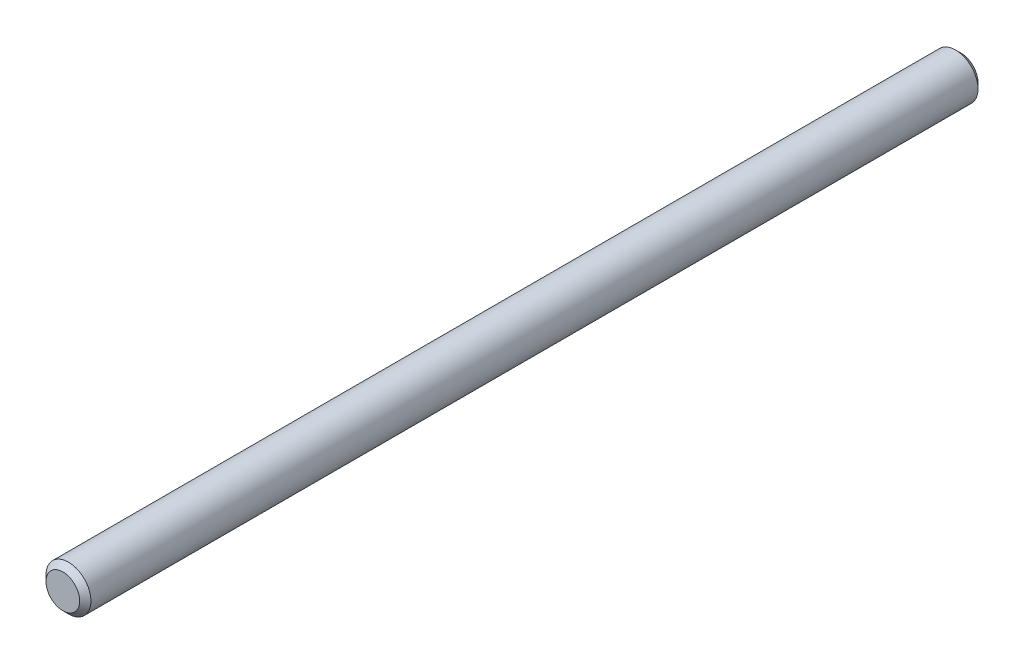
ISO-10303-21;
HEADER;
FILE_DESCRIPTION(('STEP AP214'),'2;1');
FILE_NAME('part.step','',(''),(''),'','','');
FILE_SCHEMA(('AUTOMOTIVE_DESIGN { 1 0 10303 214 1 1 1 1 }'));
ENDSEC;
DATA;
#1=APPLICATION_CONTEXT('core data for automotive mechanical design processes');
#2=APPLICATION_PROTOCOL_DEFINITION('international standard','automotive_design',2000,#1);
#3=PRODUCT_CONTEXT('',#1,'mechanical');
#4=PRODUCT('Part','Part','',(#3));
#5=PRODUCT_RELATED_PRODUCT_CATEGORY('part','',(#4));
#6=PRODUCT_DEFINITION_FORMATION('','',#4);
#7=PRODUCT_DEFINITION_CONTEXT('part definition',#1,'design');
#8=PRODUCT_DEFINITION('design','',#6,#7);
#9=PRODUCT_DEFINITION_SHAPE('','',#8);
#10=(LENGTH_UNIT() NAMED_UNIT(*) SI_UNIT(.MILLI.,.METRE.));
#11=(NAMED_UNIT(*) PLANE_ANGLE_UNIT() SI_UNIT($,.RADIAN.));
#12=(NAMED_UNIT(*) SI_UNIT($,.STERADIAN.) SOLID_ANGLE_UNIT());
#13=UNCERTAINTY_MEASURE_WITH_UNIT(LENGTH_MEASURE(1.E-05),#10,'distance_accuracy_value','');
#14=(GEOMETRIC_REPRESENTATION_CONTEXT(3) GLOBAL_UNCERTAINTY_ASSIGNED_CONTEXT((#13)) GLOBAL_UNIT_ASSIGNED_CONTEXT((#10,
#11,#12)) REPRESENTATION_CONTEXT('',''));
#15=CARTESIAN_POINT('',(0.,0.,0.));
#16=DIRECTION('',(0.,0.,1.));
#17=DIRECTION('',(1.,0.,0.));
#18=AXIS2_PLACEMENT_3D('',#15,#16,#17);
#19=CARTESIAN_POINT('',(0.,0.,160.));
#20=DIRECTION('',(0.,0.,-1.));
#21=DIRECTION('',(-1.,0.,0.));
#22=AXIS2_PLACEMENT_3D('',#19,#20,#21);
#23=CYLINDRICAL_SURFACE('',#22,4.);
#24=CARTESIAN_POINT('',(0.,0.,159.));
#25=DIRECTION('',(0.,0.,1.));
#26=DIRECTION('',(1.,0.,0.));
#27=AXIS2_PLACEMENT_3D('',#24,#25,#26);
#28=CIRCLE('',#27,4.);
#29=CARTESIAN_POINT('',(4.,0.,159.));
#30=VERTEX_POINT('',#29);
#31=EDGE_CURVE('E38',#30,#30,#28,.F.);
#32=ORIENTED_EDGE('',*,*,#31,.T.);
#33=EDGE_LOOP('',(#32));
#34=FACE_BOUND('',#33,.T.);
#35=CARTESIAN_POINT('',(0.,0.,0.999999999999973));
#36=DIRECTION('',(0.,0.,1.));
#37=DIRECTION('',(1.,0.,0.));
#38=AXIS2_PLACEMENT_3D('',#35,#36,#37);
#39=CIRCLE('',#38,4.);
#40=CARTESIAN_POINT('',(4.,0.,0.999999999999973));
#41=VERTEX_POINT('',#40);
#42=EDGE_CURVE('E42',#41,#41,#39,.T.);
#43=ORIENTED_EDGE('',*,*,#42,.T.);
#44=EDGE_LOOP('',(#43));
#45=FACE_BOUND('',#44,.T.);
#46=ADVANCED_FACE('F31',(#34,#45),#23,.T.);
#47=CARTESIAN_POINT('',(0.,0.,160.));
#48=DIRECTION('',(0.,0.,1.));
#49=DIRECTION('',(1.,0.,0.));
#50=AXIS2_PLACEMENT_3D('',#47,#48,#49);
#51=PLANE('',#50);
#52=CARTESIAN_POINT('',(0.,0.,160.));
#53=DIRECTION('',(0.,0.,1.));
#54=DIRECTION('',(1.,0.,0.));
#55=AXIS2_PLACEMENT_3D('',#52,#53,#54);
#56=CIRCLE('',#55,3.);
#57=CARTESIAN_POINT('',(3.,0.,160.));
#58=VERTEX_POINT('',#57);
#59=EDGE_CURVE('E46',#58,#58,#56,.T.);
#60=ORIENTED_EDGE('',*,*,#59,.T.);
#61=EDGE_LOOP('',(#60));
#62=FACE_BOUND('',#61,.T.);
#63=ADVANCED_FACE('F52',(#62),#51,.T.);
#64=CARTESIAN_POINT('',(0.,0.,0.));
#65=DIRECTION('',(0.,0.,1.));
#66=DIRECTION('',(1.,0.,0.));
#67=AXIS2_PLACEMENT_3D('',#64,#65,#66);
#68=PLANE('',#67);
#69=CARTESIAN_POINT('',(0.,0.,0.));
#70=DIRECTION('',(0.,0.,1.));
#71=DIRECTION('',(1.,0.,0.));
#72=AXIS2_PLACEMENT_3D('',#69,#70,#71);
#73=CIRCLE('',#72,3.);
#74=CARTESIAN_POINT('',(3.,0.,0.));
#75=VERTEX_POINT('',#74);
#76=EDGE_CURVE('E10',#75,#75,#73,.F.);
#77=ORIENTED_EDGE('',*,*,#76,.T.);
#78=EDGE_LOOP('',(#77));
#79=FACE_BOUND('',#78,.T.);
#80=ADVANCED_FACE('F56',(#79),#68,.F.);
#81=CARTESIAN_POINT('',(0.,0.,160.));
#82=DIRECTION('',(0.,0.,-1.));
#83=DIRECTION('',(-1.,0.,0.));
#84=AXIS2_PLACEMENT_3D('',#81,#82,#83);
#85=CONICAL_SURFACE('',#84,3.,0.78539816339746);
#86=ORIENTED_EDGE('',*,*,#31,.F.);
#87=EDGE_LOOP('',(#86));
#88=FACE_BOUND('',#87,.T.);
#89=ORIENTED_EDGE('',*,*,#59,.F.);
#90=EDGE_LOOP('',(#89));
#91=FACE_BOUND('',#90,.T.);
#92=ADVANCED_FACE('F54',(#88,#91),#85,.T.);
#93=CARTESIAN_POINT('',(0.,0.,0.999999999999973));
#94=DIRECTION('',(0.,0.,1.));
#95=DIRECTION('',(1.,0.,0.));
#96=AXIS2_PLACEMENT_3D('',#93,#94,#95);
#97=CONICAL_SURFACE('',#96,4.,0.78539816339746);
#98=ORIENTED_EDGE('',*,*,#76,.F.);
#99=EDGE_LOOP('',(#98));
#100=FACE_BOUND('',#99,.T.);
#101=ORIENTED_EDGE('',*,*,#42,.F.);
#102=EDGE_LOOP('',(#101));
#103=FACE_BOUND('',#102,.T.);
#104=ADVANCED_FACE('F33',(#100,#103),#97,.T.);
#105=CLOSED_SHELL('',(#46,#63,#80,#92,#104));
#106=MANIFOLD_SOLID_BREP('B2',#105);
#107=ADVANCED_BREP_SHAPE_REPRESENTATION('',(#18,#106),#14);
#108=SHAPE_DEFINITION_REPRESENTATION(#9,#107);
ENDSEC;
END-ISO-10303-21;
